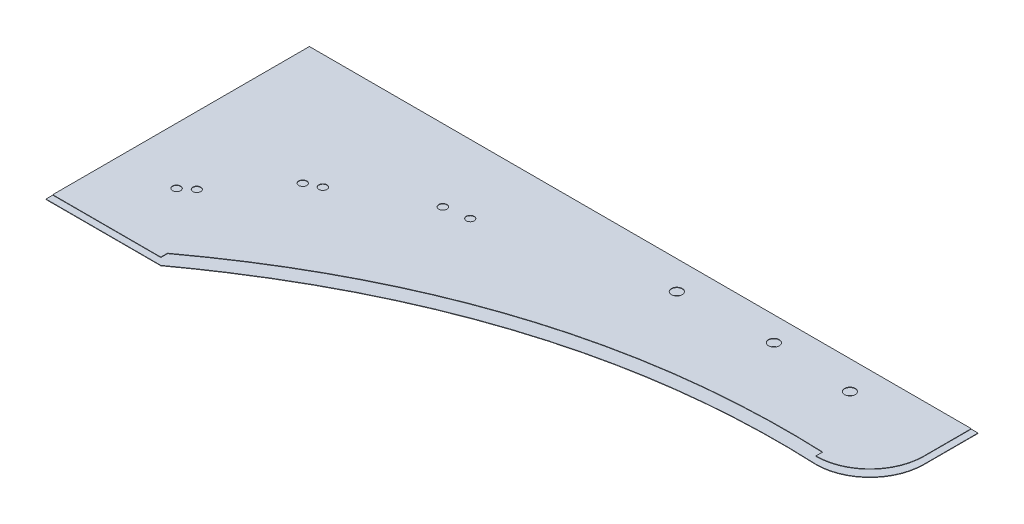
ISO-10303-21;
HEADER;
FILE_DESCRIPTION(('STEP AP214'),'2;1');
FILE_NAME('part.step','',(''),(''),'','','');
FILE_SCHEMA(('AUTOMOTIVE_DESIGN { 1 0 10303 214 1 1 1 1 }'));
ENDSEC;
DATA;
#1=APPLICATION_CONTEXT('core data for automotive mechanical design processes');
#2=APPLICATION_PROTOCOL_DEFINITION('international standard','automotive_design',2000,#1);
#3=PRODUCT_CONTEXT('',#1,'mechanical');
#4=PRODUCT('Part','Part','',(#3));
#5=PRODUCT_RELATED_PRODUCT_CATEGORY('part','',(#4));
#6=PRODUCT_DEFINITION_FORMATION('','',#4);
#7=PRODUCT_DEFINITION_CONTEXT('part definition',#1,'design');
#8=PRODUCT_DEFINITION('design','',#6,#7);
#9=PRODUCT_DEFINITION_SHAPE('','',#8);
#10=(LENGTH_UNIT() NAMED_UNIT(*) SI_UNIT(.MILLI.,.METRE.));
#11=(NAMED_UNIT(*) PLANE_ANGLE_UNIT() SI_UNIT($,.RADIAN.));
#12=(NAMED_UNIT(*) SI_UNIT($,.STERADIAN.) SOLID_ANGLE_UNIT());
#13=UNCERTAINTY_MEASURE_WITH_UNIT(LENGTH_MEASURE(1.E-05),#10,'distance_accuracy_value','');
#14=(GEOMETRIC_REPRESENTATION_CONTEXT(3) GLOBAL_UNCERTAINTY_ASSIGNED_CONTEXT((#13)) GLOBAL_UNIT_ASSIGNED_CONTEXT((#10,
#11,#12)) REPRESENTATION_CONTEXT('',''));
#15=CARTESIAN_POINT('',(0.,0.,0.));
#16=DIRECTION('',(0.,0.,1.));
#17=DIRECTION('',(1.,0.,0.));
#18=AXIS2_PLACEMENT_3D('',#15,#16,#17);
#19=CARTESIAN_POINT('',(-436.202986930584,699.7,432.681641880523));
#20=DIRECTION('',(-7.9019274698049E-10,0.,-1.));
#21=DIRECTION('',(-1.,0.,7.9019274698049E-10));
#22=AXIS2_PLACEMENT_3D('',#19,#20,#21);
#23=PLANE('',#22);
#24=DIRECTION('',(-1.,0.,7.9019274698049E-10));
#25=VECTOR('',#24,1.);
#26=CARTESIAN_POINT('',(-436.202986930584,700.,432.681641880523));
#27=LINE('',#26,#25);
#28=CARTESIAN_POINT('',(-436.202986838529,700.,432.681641813376));
#29=VERTEX_POINT('',#28);
#30=CARTESIAN_POINT('',(-521.202987022629,700.,432.681641947689));
#31=VERTEX_POINT('',#30);
#32=EDGE_CURVE('E135',#29,#31,#27,.T.);
#33=ORIENTED_EDGE('',*,*,#32,.T.);
#34=DIRECTION('',(0.,1.,0.));
#35=VECTOR('',#34,1.);
#36=CARTESIAN_POINT('',(-521.202987022629,699.7,432.681641947689));
#37=LINE('',#36,#35);
#38=CARTESIAN_POINT('',(-521.202987022629,699.7,432.681641947689));
#39=VERTEX_POINT('',#38);
#40=EDGE_CURVE('E12',#39,#31,#37,.T.);
#41=ORIENTED_EDGE('',*,*,#40,.F.);
#42=DIRECTION('',(-1.,0.,7.9019274698049E-10));
#43=VECTOR('',#42,1.);
#44=CARTESIAN_POINT('',(-436.202986930584,699.7,432.681641880523));
#45=LINE('',#44,#43);
#46=CARTESIAN_POINT('',(-436.202986838529,699.7,432.681641813376));
#47=VERTEX_POINT('',#46);
#48=EDGE_CURVE('E176',#47,#39,#45,.T.);
#49=ORIENTED_EDGE('',*,*,#48,.F.);
#50=DIRECTION('',(0.,1.,0.));
#51=VECTOR('',#50,1.);
#52=CARTESIAN_POINT('',(-436.202986838529,699.7,432.681641813376));
#53=LINE('',#52,#51);
#54=EDGE_CURVE('E128',#47,#29,#53,.T.);
#55=ORIENTED_EDGE('',*,*,#54,.T.);
#56=EDGE_LOOP('',(#33,#41,#49,#55));
#57=FACE_BOUND('',#56,.T.);
#58=ADVANCED_FACE('F46',(#57),#23,.F.);
#59=CARTESIAN_POINT('',(-521.202987022629,699.7,432.681641947689));
#60=DIRECTION('',(1.,0.,0.));
#61=DIRECTION('',(0.,0.,-1.));
#62=AXIS2_PLACEMENT_3D('',#59,#60,#61);
#63=PLANE('',#62);
#64=DIRECTION('',(0.,0.,-1.));
#65=VECTOR('',#64,1.);
#66=CARTESIAN_POINT('',(-521.202987022629,700.,432.681641947689));
#67=LINE('',#66,#65);
#68=CARTESIAN_POINT('',(-521.202987022629,700.,237.681641947689));
#69=VERTEX_POINT('',#68);
#70=EDGE_CURVE('E160',#31,#69,#67,.T.);
#71=ORIENTED_EDGE('',*,*,#70,.T.);
#72=DIRECTION('',(0.,1.,0.));
#73=VECTOR('',#72,1.);
#74=CARTESIAN_POINT('',(-521.202987022629,699.7,237.681641947689));
#75=LINE('',#74,#73);
#76=CARTESIAN_POINT('',(-521.202987022629,699.7,237.681641947689));
#77=VERTEX_POINT('',#76);
#78=EDGE_CURVE('E55',#77,#69,#75,.T.);
#79=ORIENTED_EDGE('',*,*,#78,.F.);
#80=DIRECTION('',(0.,0.,-1.));
#81=VECTOR('',#80,1.);
#82=CARTESIAN_POINT('',(-521.202987022629,699.7,432.681641947689));
#83=LINE('',#82,#81);
#84=EDGE_CURVE('E101',#39,#77,#83,.T.);
#85=ORIENTED_EDGE('',*,*,#84,.F.);
#86=ORIENTED_EDGE('',*,*,#40,.T.);
#87=EDGE_LOOP('',(#71,#79,#85,#86));
#88=FACE_BOUND('',#87,.T.);
#89=ADVANCED_FACE('F153',(#88),#63,.F.);
#90=CARTESIAN_POINT('',(-521.202987022629,699.7,237.681641947689));
#91=DIRECTION('',(0.,0.,1.));
#92=DIRECTION('',(1.,0.,0.));
#93=AXIS2_PLACEMENT_3D('',#90,#91,#92);
#94=PLANE('',#93);
#95=DIRECTION('',(1.,0.,0.));
#96=VECTOR('',#95,1.);
#97=CARTESIAN_POINT('',(-521.202987022629,700.,237.681641947689));
#98=LINE('',#97,#96);
#99=CARTESIAN_POINT('',(-26.2029870226295,700.,237.681641947689));
#100=VERTEX_POINT('',#99);
#101=EDGE_CURVE('E167',#69,#100,#98,.T.);
#102=ORIENTED_EDGE('',*,*,#101,.T.);
#103=DIRECTION('',(0.,1.,0.));
#104=VECTOR('',#103,1.);
#105=CARTESIAN_POINT('',(-26.2029870226295,699.7,237.681641947689));
#106=LINE('',#105,#104);
#107=CARTESIAN_POINT('',(-26.2029870226295,699.7,237.681641947689));
#108=VERTEX_POINT('',#107);
#109=EDGE_CURVE('E123',#108,#100,#106,.T.);
#110=ORIENTED_EDGE('',*,*,#109,.F.);
#111=DIRECTION('',(1.,0.,0.));
#112=VECTOR('',#111,1.);
#113=CARTESIAN_POINT('',(-521.202987022629,699.7,237.681641947689));
#114=LINE('',#113,#112);
#115=EDGE_CURVE('E114',#77,#108,#114,.T.);
#116=ORIENTED_EDGE('',*,*,#115,.F.);
#117=ORIENTED_EDGE('',*,*,#78,.T.);
#118=EDGE_LOOP('',(#102,#110,#116,#117));
#119=FACE_BOUND('',#118,.T.);
#120=ADVANCED_FACE('F151',(#119),#94,.F.);
#121=CARTESIAN_POINT('',(-26.2029870226295,699.7,237.681641947689));
#122=DIRECTION('',(-1.,0.,0.));
#123=DIRECTION('',(0.,0.,1.));
#124=AXIS2_PLACEMENT_3D('',#121,#122,#123);
#125=PLANE('',#124);
#126=DIRECTION('',(0.,0.,1.));
#127=VECTOR('',#126,1.);
#128=CARTESIAN_POINT('',(-26.2029870226295,700.,237.681641947689));
#129=LINE('',#128,#127);
#130=CARTESIAN_POINT('',(-26.2029870226294,700.,277.681641947689));
#131=VERTEX_POINT('',#130);
#132=EDGE_CURVE('E122',#100,#131,#129,.T.);
#133=ORIENTED_EDGE('',*,*,#132,.T.);
#134=DIRECTION('',(0.,1.,0.));
#135=VECTOR('',#134,1.);
#136=CARTESIAN_POINT('',(-26.2029870226294,699.7,277.681641947689));
#137=LINE('',#136,#135);
#138=CARTESIAN_POINT('',(-26.2029870226294,699.7,277.681641947689));
#139=VERTEX_POINT('',#138);
#140=EDGE_CURVE('E119',#139,#131,#137,.T.);
#141=ORIENTED_EDGE('',*,*,#140,.F.);
#142=DIRECTION('',(0.,0.,1.));
#143=VECTOR('',#142,1.);
#144=CARTESIAN_POINT('',(-26.2029870226295,699.7,237.681641947689));
#145=LINE('',#144,#143);
#146=EDGE_CURVE('E108',#108,#139,#145,.T.);
#147=ORIENTED_EDGE('',*,*,#146,.F.);
#148=ORIENTED_EDGE('',*,*,#109,.T.);
#149=EDGE_LOOP('',(#133,#141,#147,#148));
#150=FACE_BOUND('',#149,.T.);
#151=ADVANCED_FACE('F120',(#150),#125,.F.);
#152=CARTESIAN_POINT('',(-66.2029870226294,699.7,277.681641947689));
#153=DIRECTION('',(0.,1.,0.));
#154=DIRECTION('',(0.,0.,1.));
#155=AXIS2_PLACEMENT_3D('',#152,#153,#154);
#156=CYLINDRICAL_SURFACE('',#155,40.);
#157=CARTESIAN_POINT('',(-66.2029870226294,700.,277.681641947689));
#158=DIRECTION('',(0.,-1.,0.));
#159=DIRECTION('',(0.,0.,-1.));
#160=AXIS2_PLACEMENT_3D('',#157,#158,#159);
#161=CIRCLE('',#160,40.);
#162=CARTESIAN_POINT('',(-66.2029870226294,700.,317.681641947689));
#163=VERTEX_POINT('',#162);
#164=EDGE_CURVE('E87',#131,#163,#161,.T.);
#165=ORIENTED_EDGE('',*,*,#164,.T.);
#166=DIRECTION('',(0.,1.,0.));
#167=VECTOR('',#166,1.);
#168=CARTESIAN_POINT('',(-66.2029870226294,699.7,317.681641947689));
#169=LINE('',#168,#167);
#170=CARTESIAN_POINT('',(-66.2029870226294,699.7,317.681641947689));
#171=VERTEX_POINT('',#170);
#172=EDGE_CURVE('E124',#171,#163,#169,.T.);
#173=ORIENTED_EDGE('',*,*,#172,.F.);
#174=CARTESIAN_POINT('',(-66.2029870226294,699.7,277.681641947689));
#175=DIRECTION('',(0.,-1.,0.));
#176=DIRECTION('',(0.,0.,-1.));
#177=AXIS2_PLACEMENT_3D('',#174,#175,#176);
#178=CIRCLE('',#177,40.);
#179=EDGE_CURVE('E112',#139,#171,#178,.T.);
#180=ORIENTED_EDGE('',*,*,#179,.F.);
#181=ORIENTED_EDGE('',*,*,#140,.T.);
#182=EDGE_LOOP('',(#165,#173,#180,#181));
#183=FACE_BOUND('',#182,.T.);
#184=ADVANCED_FACE('F126',(#183),#156,.T.);
#185=CARTESIAN_POINT('',(243907.016921862,699.7,970636.245329769));
#186=CARTESIAN_POINT('',(-212077.093758222,699.7,-976969.386915229));
#187=CARTESIAN_POINT('',(179399.129928416,699.7,984620.675822955));
#188=B_SPLINE_CURVE_WITH_KNOTS('',2,(#185,#186,#187),.UNSPECIFIED.,.F.,.F.,(3,3),(0.,1.),.UNSPECIFIED.);
#189=DIRECTION('',(0.,1.,0.));
#190=VECTOR('',#189,1.);
#191=SURFACE_OF_LINEAR_EXTRUSION('',#188,#190);
#192=CARTESIAN_POINT('',(243907.016921862,700.,970636.245329769));
#193=CARTESIAN_POINT('',(-212077.093758222,700.,-976969.386915229));
#194=CARTESIAN_POINT('',(179399.129928416,700.,984620.675822955));
#195=B_SPLINE_CURVE_WITH_KNOTS('',2,(#192,#193,#194),.UNSPECIFIED.,.F.,.F.,(3,3),(0.,1.),.UNSPECIFIED.);
#196=EDGE_CURVE('E93',#163,#29,#195,.T.);
#197=ORIENTED_EDGE('',*,*,#196,.T.);
#198=ORIENTED_EDGE('',*,*,#54,.F.);
#199=EDGE_CURVE('E64',#171,#47,#188,.T.);
#200=ORIENTED_EDGE('',*,*,#199,.F.);
#201=ORIENTED_EDGE('',*,*,#172,.T.);
#202=EDGE_LOOP('',(#197,#198,#200,#201));
#203=FACE_BOUND('',#202,.T.);
#204=ADVANCED_FACE('F141',(#203),#191,.F.);
#205=CARTESIAN_POINT('',(-66.2029870226294,699.7,277.681641947689));
#206=DIRECTION('',(0.,-1.,0.));
#207=DIRECTION('',(0.,0.,-1.));
#208=AXIS2_PLACEMENT_3D('',#205,#206,#207);
#209=PLANE('',#208);
#210=CARTESIAN_POINT('',(-94.9095215443751,699.7,263.802212935845));
#211=DIRECTION('',(0.,-1.,0.));
#212=DIRECTION('',(0.,0.,-1.));
#213=AXIS2_PLACEMENT_3D('',#210,#211,#212);
#214=CIRCLE('',#213,3.99999999999999);
#215=CARTESIAN_POINT('',(-94.9095215443751,699.7,259.802212935845));
#216=VERTEX_POINT('',#215);
#217=EDGE_CURVE('E187',#216,#216,#214,.T.);
#218=ORIENTED_EDGE('',*,*,#217,.F.);
#219=EDGE_LOOP('',(#218));
#220=FACE_BOUND('',#219,.T.);
#221=CARTESIAN_POINT('',(-154.344703344319,699.7,260.643821632466));
#222=DIRECTION('',(0.,-1.,0.));
#223=DIRECTION('',(0.,0.,-1.));
#224=AXIS2_PLACEMENT_3D('',#221,#222,#223);
#225=CIRCLE('',#224,4.00000000000002);
#226=CARTESIAN_POINT('',(-154.344703344319,699.7,256.643821632466));
#227=VERTEX_POINT('',#226);
#228=EDGE_CURVE('E236',#227,#227,#225,.T.);
#229=ORIENTED_EDGE('',*,*,#228,.F.);
#230=EDGE_LOOP('',(#229));
#231=FACE_BOUND('',#230,.T.);
#232=CARTESIAN_POINT('',(-223.024834580686,699.7,263.802212935845));
#233=DIRECTION('',(0.,-1.,0.));
#234=DIRECTION('',(0.,0.,-1.));
#235=AXIS2_PLACEMENT_3D('',#232,#233,#234);
#236=CIRCLE('',#235,4.00000000000002);
#237=CARTESIAN_POINT('',(-223.024834580686,699.7,259.802212935845));
#238=VERTEX_POINT('',#237);
#239=EDGE_CURVE('E233',#238,#238,#236,.T.);
#240=ORIENTED_EDGE('',*,*,#239,.F.);
#241=EDGE_LOOP('',(#240));
#242=FACE_BOUND('',#241,.T.);
#243=CARTESIAN_POINT('',(-346.372819063942,699.7,293.429327819401));
#244=DIRECTION('',(0.,-1.,0.));
#245=DIRECTION('',(0.,0.,-1.));
#246=AXIS2_PLACEMENT_3D('',#243,#244,#245);
#247=CIRCLE('',#246,2.94464183129883);
#248=CARTESIAN_POINT('',(-346.372819063942,699.7,290.484685988103));
#249=VERTEX_POINT('',#248);
#250=EDGE_CURVE('E230',#249,#249,#247,.T.);
#251=ORIENTED_EDGE('',*,*,#250,.F.);
#252=EDGE_LOOP('',(#251));
#253=FACE_BOUND('',#252,.T.);
#254=CARTESIAN_POINT('',(-364.017672886245,699.7,296.048587357132));
#255=DIRECTION('',(0.,-1.,0.));
#256=DIRECTION('',(0.,0.,-1.));
#257=AXIS2_PLACEMENT_3D('',#254,#255,#256);
#258=CIRCLE('',#257,3.02057651298697);
#259=CARTESIAN_POINT('',(-364.017672886245,699.7,293.028010844145));
#260=VERTEX_POINT('',#259);
#261=EDGE_CURVE('E227',#260,#260,#258,.T.);
#262=ORIENTED_EDGE('',*,*,#261,.F.);
#263=EDGE_LOOP('',(#262));
#264=FACE_BOUND('',#263,.T.);
#265=CARTESIAN_POINT('',(-421.082774625095,699.7,327.80979347949));
#266=DIRECTION('',(0.,-1.,0.));
#267=DIRECTION('',(0.,0.,-1.));
#268=AXIS2_PLACEMENT_3D('',#265,#266,#267);
#269=CIRCLE('',#268,3.01217780293913);
#270=CARTESIAN_POINT('',(-421.082774625095,699.7,324.797615676551));
#271=VERTEX_POINT('',#270);
#272=EDGE_CURVE('E224',#271,#271,#269,.T.);
#273=ORIENTED_EDGE('',*,*,#272,.F.);
#274=EDGE_LOOP('',(#273));
#275=FACE_BOUND('',#274,.T.);
#276=CARTESIAN_POINT('',(-431.013382426237,699.7,332.77130718692));
#277=DIRECTION('',(0.,-1.,0.));
#278=DIRECTION('',(0.,0.,-1.));
#279=AXIS2_PLACEMENT_3D('',#276,#277,#278);
#280=CIRCLE('',#279,2.96969460121312);
#281=CARTESIAN_POINT('',(-431.013382426237,699.7,329.801612585707));
#282=VERTEX_POINT('',#281);
#283=EDGE_CURVE('E221',#282,#282,#280,.T.);
#284=ORIENTED_EDGE('',*,*,#283,.F.);
#285=EDGE_LOOP('',(#284));
#286=FACE_BOUND('',#285,.T.);
#287=CARTESIAN_POINT('',(-466.317801150332,699.7,375.92365410933));
#288=DIRECTION('',(0.,-1.,0.));
#289=DIRECTION('',(0.,0.,-1.));
#290=AXIS2_PLACEMENT_3D('',#287,#288,#289);
#291=CIRCLE('',#290,2.92635446588858);
#292=CARTESIAN_POINT('',(-466.317801150332,699.7,372.997299643442));
#293=VERTEX_POINT('',#292);
#294=EDGE_CURVE('E218',#293,#293,#291,.T.);
#295=ORIENTED_EDGE('',*,*,#294,.F.);
#296=EDGE_LOOP('',(#295));
#297=FACE_BOUND('',#296,.T.);
#298=CARTESIAN_POINT('',(-474.449169572246,699.7,382.793687092254));
#299=DIRECTION('',(0.,-1.,0.));
#300=DIRECTION('',(0.,0.,-1.));
#301=AXIS2_PLACEMENT_3D('',#298,#299,#300);
#302=CIRCLE('',#301,3.02232510648865);
#303=CARTESIAN_POINT('',(-474.449169572246,699.7,379.771361985765));
#304=VERTEX_POINT('',#303);
#305=EDGE_CURVE('E215',#304,#304,#302,.T.);
#306=ORIENTED_EDGE('',*,*,#305,.F.);
#307=EDGE_LOOP('',(#306));
#308=FACE_BOUND('',#307,.T.);
#309=ORIENTED_EDGE('',*,*,#48,.T.);
#310=ORIENTED_EDGE('',*,*,#84,.T.);
#311=ORIENTED_EDGE('',*,*,#115,.T.);
#312=ORIENTED_EDGE('',*,*,#146,.T.);
#313=ORIENTED_EDGE('',*,*,#179,.T.);
#314=ORIENTED_EDGE('',*,*,#199,.T.);
#315=EDGE_LOOP('',(#309,#310,#311,#312,#313,#314));
#316=FACE_BOUND('',#315,.T.);
#317=ADVANCED_FACE('F110',(#220,#231,#242,#253,#264,#275,#286,#297,#308,#316),#209,.T.);
#318=CARTESIAN_POINT('',(-66.2029870226294,700.,277.681641947689));
#319=DIRECTION('',(0.,-1.,0.));
#320=DIRECTION('',(0.,0.,-1.));
#321=AXIS2_PLACEMENT_3D('',#318,#319,#320);
#322=PLANE('',#321);
#323=CARTESIAN_POINT('',(-94.9095215443751,700.,263.802212935845));
#324=DIRECTION('',(0.,-1.,0.));
#325=DIRECTION('',(0.,0.,-1.));
#326=AXIS2_PLACEMENT_3D('',#323,#324,#325);
#327=CIRCLE('',#326,3.99999999999999);
#328=CARTESIAN_POINT('',(-94.9095215443751,700.,259.802212935845));
#329=VERTEX_POINT('',#328);
#330=EDGE_CURVE('E49',#329,#329,#327,.T.);
#331=ORIENTED_EDGE('',*,*,#330,.T.);
#332=EDGE_LOOP('',(#331));
#333=FACE_BOUND('',#332,.T.);
#334=CARTESIAN_POINT('',(-154.344703344319,700.,260.643821632466));
#335=DIRECTION('',(0.,-1.,0.));
#336=DIRECTION('',(0.,0.,-1.));
#337=AXIS2_PLACEMENT_3D('',#334,#335,#336);
#338=CIRCLE('',#337,4.00000000000002);
#339=CARTESIAN_POINT('',(-154.344703344319,700.,256.643821632466));
#340=VERTEX_POINT('',#339);
#341=EDGE_CURVE('E204',#340,#340,#338,.T.);
#342=ORIENTED_EDGE('',*,*,#341,.T.);
#343=EDGE_LOOP('',(#342));
#344=FACE_BOUND('',#343,.T.);
#345=CARTESIAN_POINT('',(-223.024834580686,700.,263.802212935845));
#346=DIRECTION('',(0.,-1.,0.));
#347=DIRECTION('',(0.,0.,-1.));
#348=AXIS2_PLACEMENT_3D('',#345,#346,#347);
#349=CIRCLE('',#348,4.00000000000002);
#350=CARTESIAN_POINT('',(-223.024834580686,700.,259.802212935845));
#351=VERTEX_POINT('',#350);
#352=EDGE_CURVE('E202',#351,#351,#349,.T.);
#353=ORIENTED_EDGE('',*,*,#352,.T.);
#354=EDGE_LOOP('',(#353));
#355=FACE_BOUND('',#354,.T.);
#356=CARTESIAN_POINT('',(-346.372819063942,700.,293.429327819401));
#357=DIRECTION('',(0.,-1.,0.));
#358=DIRECTION('',(0.,0.,-1.));
#359=AXIS2_PLACEMENT_3D('',#356,#357,#358);
#360=CIRCLE('',#359,2.94464183129883);
#361=CARTESIAN_POINT('',(-346.372819063942,700.,290.484685988103));
#362=VERTEX_POINT('',#361);
#363=EDGE_CURVE('E199',#362,#362,#360,.T.);
#364=ORIENTED_EDGE('',*,*,#363,.T.);
#365=EDGE_LOOP('',(#364));
#366=FACE_BOUND('',#365,.T.);
#367=CARTESIAN_POINT('',(-364.017672886245,700.,296.048587357132));
#368=DIRECTION('',(0.,-1.,0.));
#369=DIRECTION('',(0.,0.,-1.));
#370=AXIS2_PLACEMENT_3D('',#367,#368,#369);
#371=CIRCLE('',#370,3.02057651298697);
#372=CARTESIAN_POINT('',(-364.017672886245,700.,293.028010844145));
#373=VERTEX_POINT('',#372);
#374=EDGE_CURVE('E196',#373,#373,#371,.T.);
#375=ORIENTED_EDGE('',*,*,#374,.T.);
#376=EDGE_LOOP('',(#375));
#377=FACE_BOUND('',#376,.T.);
#378=CARTESIAN_POINT('',(-421.082774625095,700.,327.80979347949));
#379=DIRECTION('',(0.,-1.,0.));
#380=DIRECTION('',(0.,0.,-1.));
#381=AXIS2_PLACEMENT_3D('',#378,#379,#380);
#382=CIRCLE('',#381,3.01217780293913);
#383=CARTESIAN_POINT('',(-421.082774625095,700.,324.797615676551));
#384=VERTEX_POINT('',#383);
#385=EDGE_CURVE('E193',#384,#384,#382,.T.);
#386=ORIENTED_EDGE('',*,*,#385,.T.);
#387=EDGE_LOOP('',(#386));
#388=FACE_BOUND('',#387,.T.);
#389=CARTESIAN_POINT('',(-431.013382426237,700.,332.77130718692));
#390=DIRECTION('',(0.,-1.,0.));
#391=DIRECTION('',(0.,0.,-1.));
#392=AXIS2_PLACEMENT_3D('',#389,#390,#391);
#393=CIRCLE('',#392,2.96969460121312);
#394=CARTESIAN_POINT('',(-431.013382426237,700.,329.801612585707));
#395=VERTEX_POINT('',#394);
#396=EDGE_CURVE('E190',#395,#395,#393,.T.);
#397=ORIENTED_EDGE('',*,*,#396,.T.);
#398=EDGE_LOOP('',(#397));
#399=FACE_BOUND('',#398,.T.);
#400=CARTESIAN_POINT('',(-466.317801150332,700.,375.92365410933));
#401=DIRECTION('',(0.,-1.,0.));
#402=DIRECTION('',(0.,0.,-1.));
#403=AXIS2_PLACEMENT_3D('',#400,#401,#402);
#404=CIRCLE('',#403,2.92635446588858);
#405=CARTESIAN_POINT('',(-466.317801150332,700.,372.997299643442));
#406=VERTEX_POINT('',#405);
#407=EDGE_CURVE('E186',#406,#406,#404,.T.);
#408=ORIENTED_EDGE('',*,*,#407,.T.);
#409=EDGE_LOOP('',(#408));
#410=FACE_BOUND('',#409,.T.);
#411=CARTESIAN_POINT('',(-474.449169572246,700.,382.793687092254));
#412=DIRECTION('',(0.,-1.,0.));
#413=DIRECTION('',(0.,0.,-1.));
#414=AXIS2_PLACEMENT_3D('',#411,#412,#413);
#415=CIRCLE('',#414,3.02232510648865);
#416=CARTESIAN_POINT('',(-474.449169572246,700.,379.771361985765));
#417=VERTEX_POINT('',#416);
#418=EDGE_CURVE('E183',#417,#417,#415,.T.);
#419=ORIENTED_EDGE('',*,*,#418,.T.);
#420=EDGE_LOOP('',(#419));
#421=FACE_BOUND('',#420,.T.);
#422=ORIENTED_EDGE('',*,*,#32,.F.);
#423=ORIENTED_EDGE('',*,*,#196,.F.);
#424=ORIENTED_EDGE('',*,*,#164,.F.);
#425=ORIENTED_EDGE('',*,*,#132,.F.);
#426=ORIENTED_EDGE('',*,*,#101,.F.);
#427=ORIENTED_EDGE('',*,*,#70,.F.);
#428=EDGE_LOOP('',(#422,#423,#424,#425,#426,#427));
#429=FACE_BOUND('',#428,.T.);
#430=ADVANCED_FACE('F145',(#333,#344,#355,#366,#377,#388,#399,#410,#421,#429),#322,.F.);
#431=CARTESIAN_POINT('',(-474.449169572246,719.7,382.793687092254));
#432=DIRECTION('',(0.,-1.,0.));
#433=DIRECTION('',(0.,0.,-1.));
#434=AXIS2_PLACEMENT_3D('',#431,#432,#433);
#435=CYLINDRICAL_SURFACE('',#434,3.02232510648865);
#436=ORIENTED_EDGE('',*,*,#305,.T.);
#437=EDGE_LOOP('',(#436));
#438=FACE_BOUND('',#437,.T.);
#439=ORIENTED_EDGE('',*,*,#418,.F.);
#440=EDGE_LOOP('',(#439));
#441=FACE_BOUND('',#440,.T.);
#442=ADVANCED_FACE('F263',(#438,#441),#435,.F.);
#443=CARTESIAN_POINT('',(-466.317801150332,719.7,375.92365410933));
#444=DIRECTION('',(0.,-1.,0.));
#445=DIRECTION('',(0.,0.,-1.));
#446=AXIS2_PLACEMENT_3D('',#443,#444,#445);
#447=CYLINDRICAL_SURFACE('',#446,2.92635446588858);
#448=ORIENTED_EDGE('',*,*,#294,.T.);
#449=EDGE_LOOP('',(#448));
#450=FACE_BOUND('',#449,.T.);
#451=ORIENTED_EDGE('',*,*,#407,.F.);
#452=EDGE_LOOP('',(#451));
#453=FACE_BOUND('',#452,.T.);
#454=ADVANCED_FACE('F266',(#450,#453),#447,.F.);
#455=CARTESIAN_POINT('',(-431.013382426237,719.7,332.77130718692));
#456=DIRECTION('',(0.,-1.,0.));
#457=DIRECTION('',(0.,0.,-1.));
#458=AXIS2_PLACEMENT_3D('',#455,#456,#457);
#459=CYLINDRICAL_SURFACE('',#458,2.96969460121312);
#460=ORIENTED_EDGE('',*,*,#283,.T.);
#461=EDGE_LOOP('',(#460));
#462=FACE_BOUND('',#461,.T.);
#463=ORIENTED_EDGE('',*,*,#396,.F.);
#464=EDGE_LOOP('',(#463));
#465=FACE_BOUND('',#464,.T.);
#466=ADVANCED_FACE('F288',(#462,#465),#459,.F.);
#467=CARTESIAN_POINT('',(-421.082774625095,719.7,327.80979347949));
#468=DIRECTION('',(0.,-1.,0.));
#469=DIRECTION('',(0.,0.,-1.));
#470=AXIS2_PLACEMENT_3D('',#467,#468,#469);
#471=CYLINDRICAL_SURFACE('',#470,3.01217780293913);
#472=ORIENTED_EDGE('',*,*,#272,.T.);
#473=EDGE_LOOP('',(#472));
#474=FACE_BOUND('',#473,.T.);
#475=ORIENTED_EDGE('',*,*,#385,.F.);
#476=EDGE_LOOP('',(#475));
#477=FACE_BOUND('',#476,.T.);
#478=ADVANCED_FACE('F294',(#474,#477),#471,.F.);
#479=CARTESIAN_POINT('',(-364.017672886245,719.7,296.048587357132));
#480=DIRECTION('',(0.,-1.,0.));
#481=DIRECTION('',(0.,0.,-1.));
#482=AXIS2_PLACEMENT_3D('',#479,#480,#481);
#483=CYLINDRICAL_SURFACE('',#482,3.02057651298697);
#484=ORIENTED_EDGE('',*,*,#261,.T.);
#485=EDGE_LOOP('',(#484));
#486=FACE_BOUND('',#485,.T.);
#487=ORIENTED_EDGE('',*,*,#374,.F.);
#488=EDGE_LOOP('',(#487));
#489=FACE_BOUND('',#488,.T.);
#490=ADVANCED_FACE('F300',(#486,#489),#483,.F.);
#491=CARTESIAN_POINT('',(-346.372819063942,719.7,293.429327819401));
#492=DIRECTION('',(0.,-1.,0.));
#493=DIRECTION('',(0.,0.,-1.));
#494=AXIS2_PLACEMENT_3D('',#491,#492,#493);
#495=CYLINDRICAL_SURFACE('',#494,2.94464183129883);
#496=ORIENTED_EDGE('',*,*,#250,.T.);
#497=EDGE_LOOP('',(#496));
#498=FACE_BOUND('',#497,.T.);
#499=ORIENTED_EDGE('',*,*,#363,.F.);
#500=EDGE_LOOP('',(#499));
#501=FACE_BOUND('',#500,.T.);
#502=ADVANCED_FACE('F304',(#498,#501),#495,.F.);
#503=CARTESIAN_POINT('',(-223.024834580686,719.7,263.802212935845));
#504=DIRECTION('',(0.,-1.,0.));
#505=DIRECTION('',(0.,0.,-1.));
#506=AXIS2_PLACEMENT_3D('',#503,#504,#505);
#507=CYLINDRICAL_SURFACE('',#506,4.00000000000002);
#508=ORIENTED_EDGE('',*,*,#239,.T.);
#509=EDGE_LOOP('',(#508));
#510=FACE_BOUND('',#509,.T.);
#511=ORIENTED_EDGE('',*,*,#352,.F.);
#512=EDGE_LOOP('',(#511));
#513=FACE_BOUND('',#512,.T.);
#514=ADVANCED_FACE('F308',(#510,#513),#507,.F.);
#515=CARTESIAN_POINT('',(-154.344703344319,719.7,260.643821632466));
#516=DIRECTION('',(0.,-1.,0.));
#517=DIRECTION('',(0.,0.,-1.));
#518=AXIS2_PLACEMENT_3D('',#515,#516,#517);
#519=CYLINDRICAL_SURFACE('',#518,4.00000000000002);
#520=ORIENTED_EDGE('',*,*,#228,.T.);
#521=EDGE_LOOP('',(#520));
#522=FACE_BOUND('',#521,.T.);
#523=ORIENTED_EDGE('',*,*,#341,.F.);
#524=EDGE_LOOP('',(#523));
#525=FACE_BOUND('',#524,.T.);
#526=ADVANCED_FACE('F312',(#522,#525),#519,.F.);
#527=CARTESIAN_POINT('',(-94.9095215443751,719.7,263.802212935845));
#528=DIRECTION('',(0.,-1.,0.));
#529=DIRECTION('',(0.,0.,-1.));
#530=AXIS2_PLACEMENT_3D('',#527,#528,#529);
#531=CYLINDRICAL_SURFACE('',#530,3.99999999999999);
#532=ORIENTED_EDGE('',*,*,#217,.T.);
#533=EDGE_LOOP('',(#532));
#534=FACE_BOUND('',#533,.T.);
#535=ORIENTED_EDGE('',*,*,#330,.F.);
#536=EDGE_LOOP('',(#535));
#537=FACE_BOUND('',#536,.T.);
#538=ADVANCED_FACE('F242',(#534,#537),#531,.F.);
#539=CLOSED_SHELL('',(#58,#89,#120,#151,#184,#204,#317,#430,#442,#454,#466,#478,#490,#502,#514,
#526,#538));
#540=MANIFOLD_SOLID_BREP('B2',#539);
#541=CARTESIAN_POINT('',(221133.268668467,705.3,976081.243658897));
#542=CARTESIAN_POINT('',(-253607.150543159,705.3,-967038.901584156));
#543=CARTESIAN_POINT('',(285136.69602359,705.3,959317.615852084));
#544=B_SPLINE_CURVE_WITH_KNOTS('',2,(#541,#542,#543),.UNSPECIFIED.,.F.,.F.,(3,3),(0.,1.),.UNSPECIFIED.);
#545=DIRECTION('',(0.,-1.,0.));
#546=VECTOR('',#545,1.);
#547=SURFACE_OF_LINEAR_EXTRUSION('',#544,#546);
#548=CARTESIAN_POINT('',(221133.268668467,705.,976081.243658897));
#549=CARTESIAN_POINT('',(-253607.150543159,705.,-967038.901584156));
#550=CARTESIAN_POINT('',(285136.69602359,705.,959317.615852084));
#551=B_SPLINE_CURVE_WITH_KNOTS('',2,(#548,#549,#550),.UNSPECIFIED.,.F.,.F.,(3,3),(0.,1.),.UNSPECIFIED.);
#552=CARTESIAN_POINT('',(-436.20298693406,705.,427.681641882333));
#553=VERTEX_POINT('',#552);
#554=CARTESIAN_POINT('',(-66.2029870252319,705.,312.68164194759));
#555=VERTEX_POINT('',#554);
#556=EDGE_CURVE('E520',#553,#555,#551,.T.);
#557=ORIENTED_EDGE('',*,*,#556,.T.);
#558=DIRECTION('',(0.,-1.,0.));
#559=VECTOR('',#558,1.);
#560=CARTESIAN_POINT('',(-66.2029870252319,705.3,312.68164194759));
#561=LINE('',#560,#559);
#562=CARTESIAN_POINT('',(-66.2029870252319,705.3,312.68164194759));
#563=VERTEX_POINT('',#562);
#564=EDGE_CURVE('E44',#563,#555,#561,.T.);
#565=ORIENTED_EDGE('',*,*,#564,.F.);
#566=CARTESIAN_POINT('',(-436.20298693406,705.3,427.681641882333));
#567=VERTEX_POINT('',#566);
#568=EDGE_CURVE('E540',#567,#563,#544,.T.);
#569=ORIENTED_EDGE('',*,*,#568,.F.);
#570=DIRECTION('',(0.,-1.,0.));
#571=VECTOR('',#570,1.);
#572=CARTESIAN_POINT('',(-436.20298693406,705.3,427.681641882333));
#573=LINE('',#572,#571);
#574=EDGE_CURVE('E516',#567,#553,#573,.T.);
#575=ORIENTED_EDGE('',*,*,#574,.T.);
#576=EDGE_LOOP('',(#557,#565,#569,#575));
#577=FACE_BOUND('',#576,.T.);
#578=ADVANCED_FACE('F421',(#577),#547,.F.);
#579=CARTESIAN_POINT('',(-66.2029870252319,705.3,312.68164194759));
#580=DIRECTION('',(1.,0.,-5.20483656164187E-10));
#581=DIRECTION('',(-5.20483656164187E-10,0.,-1.));
#582=AXIS2_PLACEMENT_3D('',#579,#580,#581);
#583=PLANE('',#582);
#584=DIRECTION('',(5.20483656164187E-10,0.,1.));
#585=VECTOR('',#584,1.);
#586=CARTESIAN_POINT('',(-66.2029870252319,705.,312.68164194759));
#587=LINE('',#586,#585);
#588=CARTESIAN_POINT('',(-66.2029870226294,705.,317.681641947689));
#589=VERTEX_POINT('',#588);
#590=EDGE_CURVE('E525',#555,#589,#587,.T.);
#591=ORIENTED_EDGE('',*,*,#590,.T.);
#592=DIRECTION('',(0.,-1.,0.));
#593=VECTOR('',#592,1.);
#594=CARTESIAN_POINT('',(-66.2029870226294,705.3,317.681641947689));
#595=LINE('',#594,#593);
#596=CARTESIAN_POINT('',(-66.2029870226294,705.3,317.681641947689));
#597=VERTEX_POINT('',#596);
#598=EDGE_CURVE('E431',#597,#589,#595,.T.);
#599=ORIENTED_EDGE('',*,*,#598,.F.);
#600=DIRECTION('',(5.20483656164187E-10,0.,1.));
#601=VECTOR('',#600,1.);
#602=CARTESIAN_POINT('',(-66.2029870252319,705.3,312.68164194759));
#603=LINE('',#602,#601);
#604=EDGE_CURVE('E483',#563,#597,#603,.T.);
#605=ORIENTED_EDGE('',*,*,#604,.F.);
#606=ORIENTED_EDGE('',*,*,#564,.T.);
#607=EDGE_LOOP('',(#591,#599,#605,#606));
#608=FACE_BOUND('',#607,.T.);
#609=ADVANCED_FACE('F635',(#608),#583,.F.);
#610=CARTESIAN_POINT('',(-66.2029870226294,705.3,277.681641947689));
#611=DIRECTION('',(0.,-1.,0.));
#612=DIRECTION('',(0.,0.,-1.));
#613=AXIS2_PLACEMENT_3D('',#610,#611,#612);
#614=CYLINDRICAL_SURFACE('',#613,40.);
#615=CARTESIAN_POINT('',(-66.2029870226294,705.,277.681641947689));
#616=DIRECTION('',(0.,1.,0.));
#617=DIRECTION('',(0.,0.,1.));
#618=AXIS2_PLACEMENT_3D('',#615,#616,#617);
#619=CIRCLE('',#618,40.);
#620=CARTESIAN_POINT('',(-26.2029870226295,705.,277.681641947689));
#621=VERTEX_POINT('',#620);
#622=EDGE_CURVE('E531',#589,#621,#619,.T.);
#623=ORIENTED_EDGE('',*,*,#622,.T.);
#624=DIRECTION('',(0.,-1.,0.));
#625=VECTOR('',#624,1.);
#626=CARTESIAN_POINT('',(-26.2029870226295,705.3,277.681641947689));
#627=LINE('',#626,#625);
#628=CARTESIAN_POINT('',(-26.2029870226295,705.3,277.681641947689));
#629=VERTEX_POINT('',#628);
#630=EDGE_CURVE('E547',#629,#621,#627,.T.);
#631=ORIENTED_EDGE('',*,*,#630,.F.);
#632=CARTESIAN_POINT('',(-66.2029870226294,705.3,277.681641947689));
#633=DIRECTION('',(0.,1.,0.));
#634=DIRECTION('',(0.,0.,1.));
#635=AXIS2_PLACEMENT_3D('',#632,#633,#634);
#636=CIRCLE('',#635,40.);
#637=EDGE_CURVE('E602',#597,#629,#636,.T.);
#638=ORIENTED_EDGE('',*,*,#637,.F.);
#639=ORIENTED_EDGE('',*,*,#598,.T.);
#640=EDGE_LOOP('',(#623,#631,#638,#639));
#641=FACE_BOUND('',#640,.T.);
#642=ADVANCED_FACE('F639',(#641),#614,.T.);
#643=CARTESIAN_POINT('',(-26.2029870226295,705.3,277.681641947689));
#644=DIRECTION('',(-1.,0.,0.));
#645=DIRECTION('',(0.,0.,1.));
#646=AXIS2_PLACEMENT_3D('',#643,#644,#645);
#647=PLANE('',#646);
#648=DIRECTION('',(0.,0.,-1.));
#649=VECTOR('',#648,1.);
#650=CARTESIAN_POINT('',(-26.2029870226295,705.,277.681641947689));
#651=LINE('',#650,#649);
#652=CARTESIAN_POINT('',(-26.2029870226295,705.,242.681641947689));
#653=VERTEX_POINT('',#652);
#654=EDGE_CURVE('E533',#621,#653,#651,.T.);
#655=ORIENTED_EDGE('',*,*,#654,.T.);
#656=DIRECTION('',(0.,-1.,0.));
#657=VECTOR('',#656,1.);
#658=CARTESIAN_POINT('',(-26.2029870226295,705.3,242.681641947689));
#659=LINE('',#658,#657);
#660=CARTESIAN_POINT('',(-26.2029870226295,705.3,242.681641947689));
#661=VERTEX_POINT('',#660);
#662=EDGE_CURVE('E544',#661,#653,#659,.T.);
#663=ORIENTED_EDGE('',*,*,#662,.F.);
#664=DIRECTION('',(0.,0.,-1.));
#665=VECTOR('',#664,1.);
#666=CARTESIAN_POINT('',(-26.2029870226295,705.3,277.681641947689));
#667=LINE('',#666,#665);
#668=EDGE_CURVE('E604',#629,#661,#667,.T.);
#669=ORIENTED_EDGE('',*,*,#668,.F.);
#670=ORIENTED_EDGE('',*,*,#630,.T.);
#671=EDGE_LOOP('',(#655,#663,#669,#670));
#672=FACE_BOUND('',#671,.T.);
#673=ADVANCED_FACE('F610',(#672),#647,.F.);
#674=CARTESIAN_POINT('',(-26.2029870226295,705.3,242.681641947689));
#675=DIRECTION('',(0.,0.,1.));
#676=DIRECTION('',(1.,0.,0.));
#677=AXIS2_PLACEMENT_3D('',#674,#675,#676);
#678=PLANE('',#677);
#679=DIRECTION('',(-1.,0.,0.));
#680=VECTOR('',#679,1.);
#681=CARTESIAN_POINT('',(-26.2029870226295,705.,242.681641947689));
#682=LINE('',#681,#680);
#683=CARTESIAN_POINT('',(-516.202987022629,705.,242.681641947689));
#684=VERTEX_POINT('',#683);
#685=EDGE_CURVE('E535',#653,#684,#682,.T.);
#686=ORIENTED_EDGE('',*,*,#685,.T.);
#687=DIRECTION('',(0.,-1.,0.));
#688=VECTOR('',#687,1.);
#689=CARTESIAN_POINT('',(-516.202987022629,705.3,242.681641947689));
#690=LINE('',#689,#688);
#691=CARTESIAN_POINT('',(-516.202987022629,705.3,242.681641947689));
#692=VERTEX_POINT('',#691);
#693=EDGE_CURVE('E511',#692,#684,#690,.T.);
#694=ORIENTED_EDGE('',*,*,#693,.F.);
#695=DIRECTION('',(-1.,0.,0.));
#696=VECTOR('',#695,1.);
#697=CARTESIAN_POINT('',(-26.2029870226295,705.3,242.681641947689));
#698=LINE('',#697,#696);
#699=EDGE_CURVE('E502',#661,#692,#698,.T.);
#700=ORIENTED_EDGE('',*,*,#699,.F.);
#701=ORIENTED_EDGE('',*,*,#662,.T.);
#702=EDGE_LOOP('',(#686,#694,#700,#701));
#703=FACE_BOUND('',#702,.T.);
#704=ADVANCED_FACE('F614',(#703),#678,.F.);
#705=CARTESIAN_POINT('',(-516.202987022629,705.3,242.681641947689));
#706=DIRECTION('',(1.,0.,0.));
#707=DIRECTION('',(0.,0.,-1.));
#708=AXIS2_PLACEMENT_3D('',#705,#706,#707);
#709=PLANE('',#708);
#710=DIRECTION('',(0.,0.,1.));
#711=VECTOR('',#710,1.);
#712=CARTESIAN_POINT('',(-516.202987022629,705.,242.681641947689));
#713=LINE('',#712,#711);
#714=CARTESIAN_POINT('',(-516.202987022629,705.,432.681641947689));
#715=VERTEX_POINT('',#714);
#716=EDGE_CURVE('E510',#684,#715,#713,.T.);
#717=ORIENTED_EDGE('',*,*,#716,.T.);
#718=DIRECTION('',(0.,-1.,0.));
#719=VECTOR('',#718,1.);
#720=CARTESIAN_POINT('',(-516.202987022629,705.3,432.681641947689));
#721=LINE('',#720,#719);
#722=CARTESIAN_POINT('',(-516.202987022629,705.3,432.681641947689));
#723=VERTEX_POINT('',#722);
#724=EDGE_CURVE('E507',#723,#715,#721,.T.);
#725=ORIENTED_EDGE('',*,*,#724,.F.);
#726=DIRECTION('',(0.,0.,1.));
#727=VECTOR('',#726,1.);
#728=CARTESIAN_POINT('',(-516.202987022629,705.3,242.681641947689));
#729=LINE('',#728,#727);
#730=EDGE_CURVE('E496',#692,#723,#729,.T.);
#731=ORIENTED_EDGE('',*,*,#730,.F.);
#732=ORIENTED_EDGE('',*,*,#693,.T.);
#733=EDGE_LOOP('',(#717,#725,#731,#732));
#734=FACE_BOUND('',#733,.T.);
#735=ADVANCED_FACE('F508',(#734),#709,.F.);
#736=CARTESIAN_POINT('',(-516.202987022629,705.3,432.681641947689));
#737=DIRECTION('',(0.,0.,-1.));
#738=DIRECTION('',(-1.,0.,0.));
#739=AXIS2_PLACEMENT_3D('',#736,#737,#738);
#740=PLANE('',#739);
#741=DIRECTION('',(1.,0.,0.));
#742=VECTOR('',#741,1.);
#743=CARTESIAN_POINT('',(-516.202987022629,705.,432.681641947689));
#744=LINE('',#743,#742);
#745=CARTESIAN_POINT('',(-436.202987022629,705.,432.681641947689));
#746=VERTEX_POINT('',#745);
#747=EDGE_CURVE('E469',#715,#746,#744,.T.);
#748=ORIENTED_EDGE('',*,*,#747,.T.);
#749=DIRECTION('',(0.,-1.,0.));
#750=VECTOR('',#749,1.);
#751=CARTESIAN_POINT('',(-436.202987022629,705.3,432.681641947689));
#752=LINE('',#751,#750);
#753=CARTESIAN_POINT('',(-436.202987022629,705.3,432.681641947689));
#754=VERTEX_POINT('',#753);
#755=EDGE_CURVE('E512',#754,#746,#752,.T.);
#756=ORIENTED_EDGE('',*,*,#755,.F.);
#757=DIRECTION('',(1.,0.,0.));
#758=VECTOR('',#757,1.);
#759=CARTESIAN_POINT('',(-516.202987022629,705.3,432.681641947689));
#760=LINE('',#759,#758);
#761=EDGE_CURVE('E500',#723,#754,#760,.T.);
#762=ORIENTED_EDGE('',*,*,#761,.F.);
#763=ORIENTED_EDGE('',*,*,#724,.T.);
#764=EDGE_LOOP('',(#748,#756,#762,#763));
#765=FACE_BOUND('',#764,.T.);
#766=ADVANCED_FACE('F514',(#765),#740,.F.);
#767=CARTESIAN_POINT('',(-436.202987022629,705.3,432.681641947689));
#768=DIRECTION('',(-1.,0.,-1.77138079664975E-08));
#769=DIRECTION('',(-1.77138079664975E-08,0.,1.));
#770=AXIS2_PLACEMENT_3D('',#767,#768,#769);
#771=PLANE('',#770);
#772=DIRECTION('',(1.77138079664975E-08,0.,-1.));
#773=VECTOR('',#772,1.);
#774=CARTESIAN_POINT('',(-436.202987022629,705.,432.681641947689));
#775=LINE('',#774,#773);
#776=EDGE_CURVE('E475',#746,#553,#775,.T.);
#777=ORIENTED_EDGE('',*,*,#776,.T.);
#778=ORIENTED_EDGE('',*,*,#574,.F.);
#779=DIRECTION('',(1.77138079664975E-08,0.,-1.));
#780=VECTOR('',#779,1.);
#781=CARTESIAN_POINT('',(-436.202987022629,705.3,432.681641947689));
#782=LINE('',#781,#780);
#783=EDGE_CURVE('E440',#754,#567,#782,.T.);
#784=ORIENTED_EDGE('',*,*,#783,.F.);
#785=ORIENTED_EDGE('',*,*,#755,.T.);
#786=EDGE_LOOP('',(#777,#778,#784,#785));
#787=FACE_BOUND('',#786,.T.);
#788=ADVANCED_FACE('F622',(#787),#771,.F.);
#789=CARTESIAN_POINT('',(-236.084098565073,705.3,330.26408566738));
#790=DIRECTION('',(0.,1.,0.));
#791=DIRECTION('',(0.,0.,1.));
#792=AXIS2_PLACEMENT_3D('',#789,#790,#791);
#793=PLANE('',#792);
#794=CARTESIAN_POINT('',(-94.9095215443751,705.3,263.802212935845));
#795=DIRECTION('',(0.,1.,0.));
#796=DIRECTION('',(0.,0.,1.));
#797=AXIS2_PLACEMENT_3D('',#794,#795,#796);
#798=CIRCLE('',#797,3.99999999999999);
#799=CARTESIAN_POINT('',(-94.9095215443751,705.3,267.802212935845));
#800=VERTEX_POINT('',#799);
#801=EDGE_CURVE('E526',#800,#800,#798,.T.);
#802=ORIENTED_EDGE('',*,*,#801,.F.);
#803=EDGE_LOOP('',(#802));
#804=FACE_BOUND('',#803,.T.);
#805=CARTESIAN_POINT('',(-154.344703344319,705.3,260.643821632466));
#806=DIRECTION('',(0.,1.,0.));
#807=DIRECTION('',(0.,0.,1.));
#808=AXIS2_PLACEMENT_3D('',#805,#806,#807);
#809=CIRCLE('',#808,4.00000000000002);
#810=CARTESIAN_POINT('',(-154.344703344319,705.3,264.643821632466));
#811=VERTEX_POINT('',#810);
#812=EDGE_CURVE('E581',#811,#811,#809,.T.);
#813=ORIENTED_EDGE('',*,*,#812,.F.);
#814=EDGE_LOOP('',(#813));
#815=FACE_BOUND('',#814,.T.);
#816=CARTESIAN_POINT('',(-223.024834580686,705.3,263.802212935845));
#817=DIRECTION('',(0.,1.,0.));
#818=DIRECTION('',(0.,0.,1.));
#819=AXIS2_PLACEMENT_3D('',#816,#817,#818);
#820=CIRCLE('',#819,4.00000000000002);
#821=CARTESIAN_POINT('',(-223.024834580686,705.3,267.802212935845));
#822=VERTEX_POINT('',#821);
#823=EDGE_CURVE('E578',#822,#822,#820,.T.);
#824=ORIENTED_EDGE('',*,*,#823,.F.);
#825=EDGE_LOOP('',(#824));
#826=FACE_BOUND('',#825,.T.);
#827=CARTESIAN_POINT('',(-346.372819063942,705.3,293.429327819401));
#828=DIRECTION('',(0.,1.,0.));
#829=DIRECTION('',(0.,0.,1.));
#830=AXIS2_PLACEMENT_3D('',#827,#828,#829);
#831=CIRCLE('',#830,2.94464183129883);
#832=CARTESIAN_POINT('',(-346.372819063942,705.3,296.3739696507));
#833=VERTEX_POINT('',#832);
#834=EDGE_CURVE('E575',#833,#833,#831,.T.);
#835=ORIENTED_EDGE('',*,*,#834,.F.);
#836=EDGE_LOOP('',(#835));
#837=FACE_BOUND('',#836,.T.);
#838=CARTESIAN_POINT('',(-364.017672886245,705.3,296.048587357132));
#839=DIRECTION('',(0.,1.,0.));
#840=DIRECTION('',(0.,0.,1.));
#841=AXIS2_PLACEMENT_3D('',#838,#839,#840);
#842=CIRCLE('',#841,3.02057651298697);
#843=CARTESIAN_POINT('',(-364.017672886245,705.3,299.069163870119));
#844=VERTEX_POINT('',#843);
#845=EDGE_CURVE('E571',#844,#844,#842,.T.);
#846=ORIENTED_EDGE('',*,*,#845,.F.);
#847=EDGE_LOOP('',(#846));
#848=FACE_BOUND('',#847,.T.);
#849=CARTESIAN_POINT('',(-421.082774625095,705.3,327.80979347949));
#850=DIRECTION('',(0.,1.,0.));
#851=DIRECTION('',(0.,0.,1.));
#852=AXIS2_PLACEMENT_3D('',#849,#850,#851);
#853=CIRCLE('',#852,3.01217780293913);
#854=CARTESIAN_POINT('',(-421.082774625095,705.3,330.821971282429));
#855=VERTEX_POINT('',#854);
#856=EDGE_CURVE('E567',#855,#855,#853,.T.);
#857=ORIENTED_EDGE('',*,*,#856,.F.);
#858=EDGE_LOOP('',(#857));
#859=FACE_BOUND('',#858,.T.);
#860=CARTESIAN_POINT('',(-431.013382426237,705.3,332.77130718692));
#861=DIRECTION('',(0.,1.,0.));
#862=DIRECTION('',(0.,0.,1.));
#863=AXIS2_PLACEMENT_3D('',#860,#861,#862);
#864=CIRCLE('',#863,2.96969460121312);
#865=CARTESIAN_POINT('',(-431.013382426237,705.3,335.741001788134));
#866=VERTEX_POINT('',#865);
#867=EDGE_CURVE('E563',#866,#866,#864,.T.);
#868=ORIENTED_EDGE('',*,*,#867,.F.);
#869=EDGE_LOOP('',(#868));
#870=FACE_BOUND('',#869,.T.);
#871=CARTESIAN_POINT('',(-466.317801150332,705.3,375.92365410933));
#872=DIRECTION('',(0.,1.,0.));
#873=DIRECTION('',(0.,0.,1.));
#874=AXIS2_PLACEMENT_3D('',#871,#872,#873);
#875=CIRCLE('',#874,2.92635446588858);
#876=CARTESIAN_POINT('',(-466.317801150332,705.3,378.850008575219));
#877=VERTEX_POINT('',#876);
#878=EDGE_CURVE('E559',#877,#877,#875,.T.);
#879=ORIENTED_EDGE('',*,*,#878,.F.);
#880=EDGE_LOOP('',(#879));
#881=FACE_BOUND('',#880,.T.);
#882=CARTESIAN_POINT('',(-474.449169572246,705.3,382.793687092254));
#883=DIRECTION('',(0.,1.,0.));
#884=DIRECTION('',(0.,0.,1.));
#885=AXIS2_PLACEMENT_3D('',#882,#883,#884);
#886=CIRCLE('',#885,3.02232510648865);
#887=CARTESIAN_POINT('',(-474.449169572246,705.3,385.816012198742));
#888=VERTEX_POINT('',#887);
#889=EDGE_CURVE('E555',#888,#888,#886,.T.);
#890=ORIENTED_EDGE('',*,*,#889,.F.);
#891=EDGE_LOOP('',(#890));
#892=FACE_BOUND('',#891,.T.);
#893=ORIENTED_EDGE('',*,*,#568,.T.);
#894=ORIENTED_EDGE('',*,*,#604,.T.);
#895=ORIENTED_EDGE('',*,*,#637,.T.);
#896=ORIENTED_EDGE('',*,*,#668,.T.);
#897=ORIENTED_EDGE('',*,*,#699,.T.);
#898=ORIENTED_EDGE('',*,*,#730,.T.);
#899=ORIENTED_EDGE('',*,*,#761,.T.);
#900=ORIENTED_EDGE('',*,*,#783,.T.);
#901=EDGE_LOOP('',(#893,#894,#895,#896,#897,#898,#899,#900));
#902=FACE_BOUND('',#901,.T.);
#903=ADVANCED_FACE('F498',(#804,#815,#826,#837,#848,#859,#870,#881,#892,#902),#793,.T.);
#904=CARTESIAN_POINT('',(-236.084098565073,705.,330.26408566738));
#905=DIRECTION('',(0.,1.,0.));
#906=DIRECTION('',(0.,0.,1.));
#907=AXIS2_PLACEMENT_3D('',#904,#905,#906);
#908=PLANE('',#907);
#909=CARTESIAN_POINT('',(-94.9095215443751,705.,263.802212935845));
#910=DIRECTION('',(0.,1.,0.));
#911=DIRECTION('',(0.,0.,1.));
#912=AXIS2_PLACEMENT_3D('',#909,#910,#911);
#913=CIRCLE('',#912,3.99999999999999);
#914=CARTESIAN_POINT('',(-94.9095215443751,705.,267.802212935845));
#915=VERTEX_POINT('',#914);
#916=EDGE_CURVE('E425',#915,#915,#913,.T.);
#917=ORIENTED_EDGE('',*,*,#916,.T.);
#918=EDGE_LOOP('',(#917));
#919=FACE_BOUND('',#918,.T.);
#920=CARTESIAN_POINT('',(-154.344703344319,705.,260.643821632466));
#921=DIRECTION('',(0.,1.,0.));
#922=DIRECTION('',(0.,0.,1.));
#923=AXIS2_PLACEMENT_3D('',#920,#921,#922);
#924=CIRCLE('',#923,4.00000000000002);
#925=CARTESIAN_POINT('',(-154.344703344319,705.,264.643821632466));
#926=VERTEX_POINT('',#925);
#927=EDGE_CURVE('E579',#926,#926,#924,.T.);
#928=ORIENTED_EDGE('',*,*,#927,.T.);
#929=EDGE_LOOP('',(#928));
#930=FACE_BOUND('',#929,.T.);
#931=CARTESIAN_POINT('',(-223.024834580686,705.,263.802212935845));
#932=DIRECTION('',(0.,1.,0.));
#933=DIRECTION('',(0.,0.,1.));
#934=AXIS2_PLACEMENT_3D('',#931,#932,#933);
#935=CIRCLE('',#934,4.00000000000002);
#936=CARTESIAN_POINT('',(-223.024834580686,705.,267.802212935845));
#937=VERTEX_POINT('',#936);
#938=EDGE_CURVE('E576',#937,#937,#935,.T.);
#939=ORIENTED_EDGE('',*,*,#938,.T.);
#940=EDGE_LOOP('',(#939));
#941=FACE_BOUND('',#940,.T.);
#942=CARTESIAN_POINT('',(-346.372819063942,705.,293.429327819401));
#943=DIRECTION('',(0.,1.,0.));
#944=DIRECTION('',(0.,0.,1.));
#945=AXIS2_PLACEMENT_3D('',#942,#943,#944);
#946=CIRCLE('',#945,2.94464183129883);
#947=CARTESIAN_POINT('',(-346.372819063942,705.,296.3739696507));
#948=VERTEX_POINT('',#947);
#949=EDGE_CURVE('E572',#948,#948,#946,.T.);
#950=ORIENTED_EDGE('',*,*,#949,.T.);
#951=EDGE_LOOP('',(#950));
#952=FACE_BOUND('',#951,.T.);
#953=CARTESIAN_POINT('',(-364.017672886245,705.,296.048587357132));
#954=DIRECTION('',(0.,1.,0.));
#955=DIRECTION('',(0.,0.,1.));
#956=AXIS2_PLACEMENT_3D('',#953,#954,#955);
#957=CIRCLE('',#956,3.02057651298697);
#958=CARTESIAN_POINT('',(-364.017672886245,705.,299.069163870119));
#959=VERTEX_POINT('',#958);
#960=EDGE_CURVE('E568',#959,#959,#957,.T.);
#961=ORIENTED_EDGE('',*,*,#960,.T.);
#962=EDGE_LOOP('',(#961));
#963=FACE_BOUND('',#962,.T.);
#964=CARTESIAN_POINT('',(-421.082774625095,705.,327.80979347949));
#965=DIRECTION('',(0.,1.,0.));
#966=DIRECTION('',(0.,0.,1.));
#967=AXIS2_PLACEMENT_3D('',#964,#965,#966);
#968=CIRCLE('',#967,3.01217780293913);
#969=CARTESIAN_POINT('',(-421.082774625095,705.,330.821971282429));
#970=VERTEX_POINT('',#969);
#971=EDGE_CURVE('E564',#970,#970,#968,.T.);
#972=ORIENTED_EDGE('',*,*,#971,.T.);
#973=EDGE_LOOP('',(#972));
#974=FACE_BOUND('',#973,.T.);
#975=CARTESIAN_POINT('',(-431.013382426237,705.,332.77130718692));
#976=DIRECTION('',(0.,1.,0.));
#977=DIRECTION('',(0.,0.,1.));
#978=AXIS2_PLACEMENT_3D('',#975,#976,#977);
#979=CIRCLE('',#978,2.96969460121312);
#980=CARTESIAN_POINT('',(-431.013382426237,705.,335.741001788134));
#981=VERTEX_POINT('',#980);
#982=EDGE_CURVE('E560',#981,#981,#979,.T.);
#983=ORIENTED_EDGE('',*,*,#982,.T.);
#984=EDGE_LOOP('',(#983));
#985=FACE_BOUND('',#984,.T.);
#986=CARTESIAN_POINT('',(-466.317801150332,705.,375.92365410933));
#987=DIRECTION('',(0.,1.,0.));
#988=DIRECTION('',(0.,0.,1.));
#989=AXIS2_PLACEMENT_3D('',#986,#987,#988);
#990=CIRCLE('',#989,2.92635446588858);
#991=CARTESIAN_POINT('',(-466.317801150332,705.,378.850008575219));
#992=VERTEX_POINT('',#991);
#993=EDGE_CURVE('E556',#992,#992,#990,.T.);
#994=ORIENTED_EDGE('',*,*,#993,.T.);
#995=EDGE_LOOP('',(#994));
#996=FACE_BOUND('',#995,.T.);
#997=CARTESIAN_POINT('',(-474.449169572246,705.,382.793687092254));
#998=DIRECTION('',(0.,1.,0.));
#999=DIRECTION('',(0.,0.,1.));
#1000=AXIS2_PLACEMENT_3D('',#997,#998,#999);
#1001=CIRCLE('',#1000,3.02232510648865);
#1002=CARTESIAN_POINT('',(-474.449169572246,705.,385.816012198742));
#1003=VERTEX_POINT('',#1002);
#1004=EDGE_CURVE('E552',#1003,#1003,#1001,.T.);
#1005=ORIENTED_EDGE('',*,*,#1004,.T.);
#1006=EDGE_LOOP('',(#1005));
#1007=FACE_BOUND('',#1006,.T.);
#1008=ORIENTED_EDGE('',*,*,#556,.F.);
#1009=ORIENTED_EDGE('',*,*,#776,.F.);
#1010=ORIENTED_EDGE('',*,*,#747,.F.);
#1011=ORIENTED_EDGE('',*,*,#716,.F.);
#1012=ORIENTED_EDGE('',*,*,#685,.F.);
#1013=ORIENTED_EDGE('',*,*,#654,.F.);
#1014=ORIENTED_EDGE('',*,*,#622,.F.);
#1015=ORIENTED_EDGE('',*,*,#590,.F.);
#1016=EDGE_LOOP('',(#1008,#1009,#1010,#1011,#1012,#1013,#1014,#1015));
#1017=FACE_BOUND('',#1016,.T.);
#1018=ADVANCED_FACE('F617',(#919,#930,#941,#952,#963,#974,#985,#996,#1007,#1017),#908,.F.);
#1019=CARTESIAN_POINT('',(-474.449169572246,719.7,382.793687092254));
#1020=DIRECTION('',(0.,-1.,0.));
#1021=DIRECTION('',(0.,0.,-1.));
#1022=AXIS2_PLACEMENT_3D('',#1019,#1020,#1021);
#1023=CYLINDRICAL_SURFACE('',#1022,3.02232510648865);
#1024=ORIENTED_EDGE('',*,*,#889,.T.);
#1025=EDGE_LOOP('',(#1024));
#1026=FACE_BOUND('',#1025,.T.);
#1027=ORIENTED_EDGE('',*,*,#1004,.F.);
#1028=EDGE_LOOP('',(#1027));
#1029=FACE_BOUND('',#1028,.T.);
#1030=ADVANCED_FACE('F674',(#1026,#1029),#1023,.F.);
#1031=CARTESIAN_POINT('',(-466.317801150332,719.7,375.92365410933));
#1032=DIRECTION('',(0.,-1.,0.));
#1033=DIRECTION('',(0.,0.,-1.));
#1034=AXIS2_PLACEMENT_3D('',#1031,#1032,#1033);
#1035=CYLINDRICAL_SURFACE('',#1034,2.92635446588858);
#1036=ORIENTED_EDGE('',*,*,#878,.T.);
#1037=EDGE_LOOP('',(#1036));
#1038=FACE_BOUND('',#1037,.T.);
#1039=ORIENTED_EDGE('',*,*,#993,.F.);
#1040=EDGE_LOOP('',(#1039));
#1041=FACE_BOUND('',#1040,.T.);
#1042=ADVANCED_FACE('F682',(#1038,#1041),#1035,.F.);
#1043=CARTESIAN_POINT('',(-431.013382426237,719.7,332.77130718692));
#1044=DIRECTION('',(0.,-1.,0.));
#1045=DIRECTION('',(0.,0.,-1.));
#1046=AXIS2_PLACEMENT_3D('',#1043,#1044,#1045);
#1047=CYLINDRICAL_SURFACE('',#1046,2.96969460121312);
#1048=ORIENTED_EDGE('',*,*,#867,.T.);
#1049=EDGE_LOOP('',(#1048));
#1050=FACE_BOUND('',#1049,.T.);
#1051=ORIENTED_EDGE('',*,*,#982,.F.);
#1052=EDGE_LOOP('',(#1051));
#1053=FACE_BOUND('',#1052,.T.);
#1054=ADVANCED_FACE('F692',(#1050,#1053),#1047,.F.);
#1055=CARTESIAN_POINT('',(-421.082774625095,719.7,327.80979347949));
#1056=DIRECTION('',(0.,-1.,0.));
#1057=DIRECTION('',(0.,0.,-1.));
#1058=AXIS2_PLACEMENT_3D('',#1055,#1056,#1057);
#1059=CYLINDRICAL_SURFACE('',#1058,3.01217780293913);
#1060=ORIENTED_EDGE('',*,*,#856,.T.);
#1061=EDGE_LOOP('',(#1060));
#1062=FACE_BOUND('',#1061,.T.);
#1063=ORIENTED_EDGE('',*,*,#971,.F.);
#1064=EDGE_LOOP('',(#1063));
#1065=FACE_BOUND('',#1064,.T.);
#1066=ADVANCED_FACE('F702',(#1062,#1065),#1059,.F.);
#1067=CARTESIAN_POINT('',(-364.017672886245,719.7,296.048587357132));
#1068=DIRECTION('',(0.,-1.,0.));
#1069=DIRECTION('',(0.,0.,-1.));
#1070=AXIS2_PLACEMENT_3D('',#1067,#1068,#1069);
#1071=CYLINDRICAL_SURFACE('',#1070,3.02057651298697);
#1072=ORIENTED_EDGE('',*,*,#845,.T.);
#1073=EDGE_LOOP('',(#1072));
#1074=FACE_BOUND('',#1073,.T.);
#1075=ORIENTED_EDGE('',*,*,#960,.F.);
#1076=EDGE_LOOP('',(#1075));
#1077=FACE_BOUND('',#1076,.T.);
#1078=ADVANCED_FACE('F712',(#1074,#1077),#1071,.F.);
#1079=CARTESIAN_POINT('',(-346.372819063942,719.7,293.429327819401));
#1080=DIRECTION('',(0.,-1.,0.));
#1081=DIRECTION('',(0.,0.,-1.));
#1082=AXIS2_PLACEMENT_3D('',#1079,#1080,#1081);
#1083=CYLINDRICAL_SURFACE('',#1082,2.94464183129883);
#1084=ORIENTED_EDGE('',*,*,#834,.T.);
#1085=EDGE_LOOP('',(#1084));
#1086=FACE_BOUND('',#1085,.T.);
#1087=ORIENTED_EDGE('',*,*,#949,.F.);
#1088=EDGE_LOOP('',(#1087));
#1089=FACE_BOUND('',#1088,.T.);
#1090=ADVANCED_FACE('F722',(#1086,#1089),#1083,.F.);
#1091=CARTESIAN_POINT('',(-223.024834580686,719.7,263.802212935845));
#1092=DIRECTION('',(0.,-1.,0.));
#1093=DIRECTION('',(0.,0.,-1.));
#1094=AXIS2_PLACEMENT_3D('',#1091,#1092,#1093);
#1095=CYLINDRICAL_SURFACE('',#1094,4.00000000000002);
#1096=ORIENTED_EDGE('',*,*,#823,.T.);
#1097=EDGE_LOOP('',(#1096));
#1098=FACE_BOUND('',#1097,.T.);
#1099=ORIENTED_EDGE('',*,*,#938,.F.);
#1100=EDGE_LOOP('',(#1099));
#1101=FACE_BOUND('',#1100,.T.);
#1102=ADVANCED_FACE('F732',(#1098,#1101),#1095,.F.);
#1103=CARTESIAN_POINT('',(-154.344703344319,719.7,260.643821632466));
#1104=DIRECTION('',(0.,-1.,0.));
#1105=DIRECTION('',(0.,0.,-1.));
#1106=AXIS2_PLACEMENT_3D('',#1103,#1104,#1105);
#1107=CYLINDRICAL_SURFACE('',#1106,4.00000000000002);
#1108=ORIENTED_EDGE('',*,*,#812,.T.);
#1109=EDGE_LOOP('',(#1108));
#1110=FACE_BOUND('',#1109,.T.);
#1111=ORIENTED_EDGE('',*,*,#927,.F.);
#1112=EDGE_LOOP('',(#1111));
#1113=FACE_BOUND('',#1112,.T.);
#1114=ADVANCED_FACE('F742',(#1110,#1113),#1107,.F.);
#1115=CARTESIAN_POINT('',(-94.9095215443751,719.7,263.802212935845));
#1116=DIRECTION('',(0.,-1.,0.));
#1117=DIRECTION('',(0.,0.,-1.));
#1118=AXIS2_PLACEMENT_3D('',#1115,#1116,#1117);
#1119=CYLINDRICAL_SURFACE('',#1118,3.99999999999999);
#1120=ORIENTED_EDGE('',*,*,#801,.T.);
#1121=EDGE_LOOP('',(#1120));
#1122=FACE_BOUND('',#1121,.T.);
#1123=ORIENTED_EDGE('',*,*,#916,.F.);
#1124=EDGE_LOOP('',(#1123));
#1125=FACE_BOUND('',#1124,.T.);
#1126=ADVANCED_FACE('F751',(#1122,#1125),#1119,.F.);
#1127=CLOSED_SHELL('',(#578,#609,#642,#673,#704,#735,#766,#788,#903,#1018,#1030,#1042,#1054,
#1066,#1078,#1090,#1102,#1114,#1126));
#1128=MANIFOLD_SOLID_BREP('B6',#1127);
#1129=ADVANCED_BREP_SHAPE_REPRESENTATION('',(#18,#540,#1128),#14);
#1130=SHAPE_DEFINITION_REPRESENTATION(#9,#1129);
ENDSEC;
END-ISO-10303-21;
